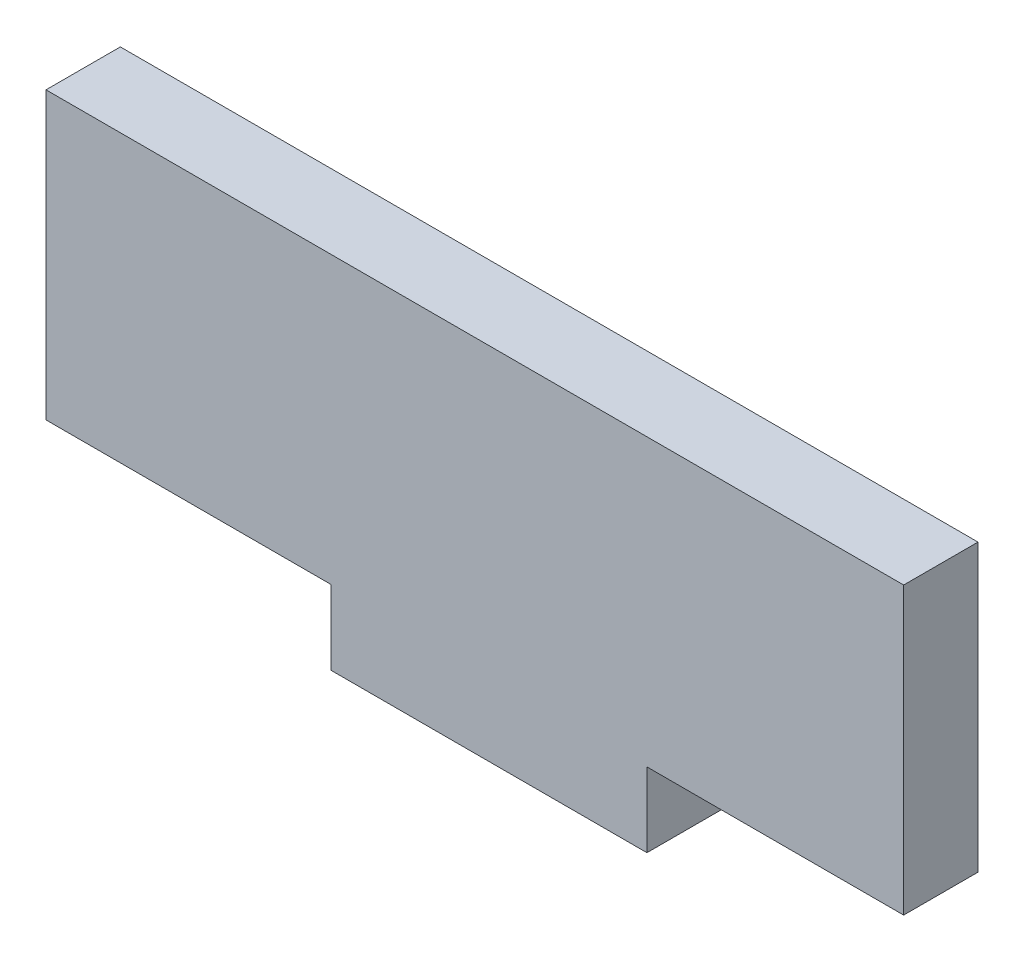
ISO-10303-21;
HEADER;
FILE_DESCRIPTION(('STEP AP214'),'2;1');
FILE_NAME('part.step','',(''),(''),'','','');
FILE_SCHEMA(('AUTOMOTIVE_DESIGN { 1 0 10303 214 1 1 1 1 }'));
ENDSEC;
DATA;
#1=APPLICATION_CONTEXT('core data for automotive mechanical design processes');
#2=APPLICATION_PROTOCOL_DEFINITION('international standard','automotive_design',2000,#1);
#3=PRODUCT_CONTEXT('',#1,'mechanical');
#4=PRODUCT('Part','Part','',(#3));
#5=PRODUCT_RELATED_PRODUCT_CATEGORY('part','',(#4));
#6=PRODUCT_DEFINITION_FORMATION('','',#4);
#7=PRODUCT_DEFINITION_CONTEXT('part definition',#1,'design');
#8=PRODUCT_DEFINITION('design','',#6,#7);
#9=PRODUCT_DEFINITION_SHAPE('','',#8);
#10=(LENGTH_UNIT() NAMED_UNIT(*) SI_UNIT(.MILLI.,.METRE.));
#11=(NAMED_UNIT(*) PLANE_ANGLE_UNIT() SI_UNIT($,.RADIAN.));
#12=(NAMED_UNIT(*) SI_UNIT($,.STERADIAN.) SOLID_ANGLE_UNIT());
#13=UNCERTAINTY_MEASURE_WITH_UNIT(LENGTH_MEASURE(1.E-05),#10,'distance_accuracy_value','');
#14=(GEOMETRIC_REPRESENTATION_CONTEXT(3) GLOBAL_UNCERTAINTY_ASSIGNED_CONTEXT((#13)) GLOBAL_UNIT_ASSIGNED_CONTEXT((#10,
#11,#12)) REPRESENTATION_CONTEXT('',''));
#15=CARTESIAN_POINT('',(0.,0.,0.));
#16=DIRECTION('',(0.,0.,1.));
#17=DIRECTION('',(1.,0.,0.));
#18=AXIS2_PLACEMENT_3D('',#15,#16,#17);
#19=CARTESIAN_POINT('',(0.,0.,2.6));
#20=DIRECTION('',(1.,0.,0.));
#21=DIRECTION('',(0.,0.,-1.));
#22=AXIS2_PLACEMENT_3D('',#19,#20,#21);
#23=PLANE('',#22);
#24=DIRECTION('',(0.,-1.,0.));
#25=VECTOR('',#24,1.);
#26=CARTESIAN_POINT('',(0.,0.,0.));
#27=LINE('',#26,#25);
#28=CARTESIAN_POINT('',(0.,10.,0.));
#29=VERTEX_POINT('',#28);
#30=CARTESIAN_POINT('',(0.,0.,0.));
#31=VERTEX_POINT('',#30);
#32=EDGE_CURVE('E126',#29,#31,#27,.T.);
#33=ORIENTED_EDGE('',*,*,#32,.T.);
#34=DIRECTION('',(0.,0.,-1.));
#35=VECTOR('',#34,1.);
#36=CARTESIAN_POINT('',(0.,0.,2.6));
#37=LINE('',#36,#35);
#38=CARTESIAN_POINT('',(0.,0.,2.6));
#39=VERTEX_POINT('',#38);
#40=EDGE_CURVE('E11',#39,#31,#37,.T.);
#41=ORIENTED_EDGE('',*,*,#40,.F.);
#42=DIRECTION('',(0.,-1.,0.));
#43=VECTOR('',#42,1.);
#44=CARTESIAN_POINT('',(0.,0.,2.6));
#45=LINE('',#44,#43);
#46=CARTESIAN_POINT('',(0.,10.,2.6));
#47=VERTEX_POINT('',#46);
#48=EDGE_CURVE('E140',#47,#39,#45,.T.);
#49=ORIENTED_EDGE('',*,*,#48,.F.);
#50=DIRECTION('',(0.,0.,-1.));
#51=VECTOR('',#50,1.);
#52=CARTESIAN_POINT('',(0.,10.,2.6));
#53=LINE('',#52,#51);
#54=EDGE_CURVE('E122',#47,#29,#53,.T.);
#55=ORIENTED_EDGE('',*,*,#54,.T.);
#56=EDGE_LOOP('',(#33,#41,#49,#55));
#57=FACE_BOUND('',#56,.T.);
#58=ADVANCED_FACE('F30',(#57),#23,.F.);
#59=CARTESIAN_POINT('',(0.,0.,2.6));
#60=DIRECTION('',(0.,1.,0.));
#61=DIRECTION('',(0.,0.,1.));
#62=AXIS2_PLACEMENT_3D('',#59,#60,#61);
#63=PLANE('',#62);
#64=DIRECTION('',(1.,0.,0.));
#65=VECTOR('',#64,1.);
#66=CARTESIAN_POINT('',(0.,0.,0.));
#67=LINE('',#66,#65);
#68=CARTESIAN_POINT('',(9.97731138012756,0.,0.));
#69=VERTEX_POINT('',#68);
#70=EDGE_CURVE('E129',#31,#69,#67,.T.);
#71=ORIENTED_EDGE('',*,*,#70,.T.);
#72=DIRECTION('',(0.,0.,-1.));
#73=VECTOR('',#72,1.);
#74=CARTESIAN_POINT('',(9.97731138012756,0.,2.6));
#75=LINE('',#74,#73);
#76=CARTESIAN_POINT('',(9.97731138012756,0.,2.6));
#77=VERTEX_POINT('',#76);
#78=EDGE_CURVE('E38',#77,#69,#75,.T.);
#79=ORIENTED_EDGE('',*,*,#78,.F.);
#80=DIRECTION('',(1.,0.,0.));
#81=VECTOR('',#80,1.);
#82=CARTESIAN_POINT('',(0.,0.,2.6));
#83=LINE('',#82,#81);
#84=EDGE_CURVE('E89',#39,#77,#83,.T.);
#85=ORIENTED_EDGE('',*,*,#84,.F.);
#86=ORIENTED_EDGE('',*,*,#40,.T.);
#87=EDGE_LOOP('',(#71,#79,#85,#86));
#88=FACE_BOUND('',#87,.T.);
#89=ADVANCED_FACE('F175',(#88),#63,.F.);
#90=CARTESIAN_POINT('',(9.97731138012756,0.,2.6));
#91=DIRECTION('',(1.,0.,0.));
#92=DIRECTION('',(0.,0.,-1.));
#93=AXIS2_PLACEMENT_3D('',#90,#91,#92);
#94=PLANE('',#93);
#95=DIRECTION('',(0.,-1.,0.));
#96=VECTOR('',#95,1.);
#97=CARTESIAN_POINT('',(9.97731138012756,0.,0.));
#98=LINE('',#97,#96);
#99=CARTESIAN_POINT('',(9.97731138012756,-2.6,0.));
#100=VERTEX_POINT('',#99);
#101=EDGE_CURVE('E131',#69,#100,#98,.T.);
#102=ORIENTED_EDGE('',*,*,#101,.T.);
#103=DIRECTION('',(0.,0.,-1.));
#104=VECTOR('',#103,1.);
#105=CARTESIAN_POINT('',(9.97731138012756,-2.6,2.6));
#106=LINE('',#105,#104);
#107=CARTESIAN_POINT('',(9.97731138012756,-2.6,2.6));
#108=VERTEX_POINT('',#107);
#109=EDGE_CURVE('E147',#108,#100,#106,.T.);
#110=ORIENTED_EDGE('',*,*,#109,.F.);
#111=DIRECTION('',(0.,-1.,0.));
#112=VECTOR('',#111,1.);
#113=CARTESIAN_POINT('',(9.97731138012756,0.,2.6));
#114=LINE('',#113,#112);
#115=EDGE_CURVE('E155',#77,#108,#114,.T.);
#116=ORIENTED_EDGE('',*,*,#115,.F.);
#117=ORIENTED_EDGE('',*,*,#78,.T.);
#118=EDGE_LOOP('',(#102,#110,#116,#117));
#119=FACE_BOUND('',#118,.T.);
#120=ADVANCED_FACE('F153',(#119),#94,.F.);
#121=CARTESIAN_POINT('',(9.97731138012756,-2.6,2.6));
#122=DIRECTION('',(0.,1.,0.));
#123=DIRECTION('',(0.,0.,1.));
#124=AXIS2_PLACEMENT_3D('',#121,#122,#123);
#125=PLANE('',#124);
#126=DIRECTION('',(1.,0.,0.));
#127=VECTOR('',#126,1.);
#128=CARTESIAN_POINT('',(9.97731138012756,-2.6,0.));
#129=LINE('',#128,#127);
#130=CARTESIAN_POINT('',(21.0201608688124,-2.6,0.));
#131=VERTEX_POINT('',#130);
#132=EDGE_CURVE('E133',#100,#131,#129,.T.);
#133=ORIENTED_EDGE('',*,*,#132,.T.);
#134=DIRECTION('',(0.,0.,-1.));
#135=VECTOR('',#134,1.);
#136=CARTESIAN_POINT('',(21.0201608688124,-2.6,2.6));
#137=LINE('',#136,#135);
#138=CARTESIAN_POINT('',(21.0201608688124,-2.6,2.6));
#139=VERTEX_POINT('',#138);
#140=EDGE_CURVE('E144',#139,#131,#137,.T.);
#141=ORIENTED_EDGE('',*,*,#140,.F.);
#142=DIRECTION('',(1.,0.,0.));
#143=VECTOR('',#142,1.);
#144=CARTESIAN_POINT('',(9.97731138012756,-2.6,2.6));
#145=LINE('',#144,#143);
#146=EDGE_CURVE('E167',#108,#139,#145,.T.);
#147=ORIENTED_EDGE('',*,*,#146,.F.);
#148=ORIENTED_EDGE('',*,*,#109,.T.);
#149=EDGE_LOOP('',(#133,#141,#147,#148));
#150=FACE_BOUND('',#149,.T.);
#151=ADVANCED_FACE('F163',(#150),#125,.F.);
#152=CARTESIAN_POINT('',(21.0201608688124,0.,2.6));
#153=DIRECTION('',(-1.,0.,0.));
#154=DIRECTION('',(0.,0.,1.));
#155=AXIS2_PLACEMENT_3D('',#152,#153,#154);
#156=PLANE('',#155);
#157=DIRECTION('',(0.,1.,0.));
#158=VECTOR('',#157,1.);
#159=CARTESIAN_POINT('',(21.0201608688124,0.,0.));
#160=LINE('',#159,#158);
#161=CARTESIAN_POINT('',(21.0201608688124,0.,0.));
#162=VERTEX_POINT('',#161);
#163=EDGE_CURVE('E135',#131,#162,#160,.T.);
#164=ORIENTED_EDGE('',*,*,#163,.T.);
#165=DIRECTION('',(0.,0.,-1.));
#166=VECTOR('',#165,1.);
#167=CARTESIAN_POINT('',(21.0201608688124,0.,2.6));
#168=LINE('',#167,#166);
#169=CARTESIAN_POINT('',(21.0201608688124,0.,2.6));
#170=VERTEX_POINT('',#169);
#171=EDGE_CURVE('E117',#170,#162,#168,.T.);
#172=ORIENTED_EDGE('',*,*,#171,.F.);
#173=DIRECTION('',(0.,1.,0.));
#174=VECTOR('',#173,1.);
#175=CARTESIAN_POINT('',(21.0201608688124,0.,2.6));
#176=LINE('',#175,#174);
#177=EDGE_CURVE('E108',#139,#170,#176,.T.);
#178=ORIENTED_EDGE('',*,*,#177,.F.);
#179=ORIENTED_EDGE('',*,*,#140,.T.);
#180=EDGE_LOOP('',(#164,#172,#178,#179));
#181=FACE_BOUND('',#180,.T.);
#182=ADVANCED_FACE('F166',(#181),#156,.F.);
#183=CARTESIAN_POINT('',(21.0201608688124,0.,2.6));
#184=DIRECTION('',(0.,1.,0.));
#185=DIRECTION('',(0.,0.,1.));
#186=AXIS2_PLACEMENT_3D('',#183,#184,#185);
#187=PLANE('',#186);
#188=DIRECTION('',(1.,0.,0.));
#189=VECTOR('',#188,1.);
#190=CARTESIAN_POINT('',(21.0201608688124,0.,0.));
#191=LINE('',#190,#189);
#192=CARTESIAN_POINT('',(30.,0.,0.));
#193=VERTEX_POINT('',#192);
#194=EDGE_CURVE('E116',#162,#193,#191,.T.);
#195=ORIENTED_EDGE('',*,*,#194,.T.);
#196=DIRECTION('',(0.,0.,-1.));
#197=VECTOR('',#196,1.);
#198=CARTESIAN_POINT('',(30.,0.,2.6));
#199=LINE('',#198,#197);
#200=CARTESIAN_POINT('',(30.,0.,2.6));
#201=VERTEX_POINT('',#200);
#202=EDGE_CURVE('E113',#201,#193,#199,.T.);
#203=ORIENTED_EDGE('',*,*,#202,.F.);
#204=DIRECTION('',(1.,0.,0.));
#205=VECTOR('',#204,1.);
#206=CARTESIAN_POINT('',(21.0201608688124,0.,2.6));
#207=LINE('',#206,#205);
#208=EDGE_CURVE('E102',#170,#201,#207,.T.);
#209=ORIENTED_EDGE('',*,*,#208,.F.);
#210=ORIENTED_EDGE('',*,*,#171,.T.);
#211=EDGE_LOOP('',(#195,#203,#209,#210));
#212=FACE_BOUND('',#211,.T.);
#213=ADVANCED_FACE('F114',(#212),#187,.F.);
#214=CARTESIAN_POINT('',(30.,0.,2.6));
#215=DIRECTION('',(-1.,0.,0.));
#216=DIRECTION('',(0.,0.,1.));
#217=AXIS2_PLACEMENT_3D('',#214,#215,#216);
#218=PLANE('',#217);
#219=DIRECTION('',(0.,1.,0.));
#220=VECTOR('',#219,1.);
#221=CARTESIAN_POINT('',(30.,0.,0.));
#222=LINE('',#221,#220);
#223=CARTESIAN_POINT('',(30.,10.,0.));
#224=VERTEX_POINT('',#223);
#225=EDGE_CURVE('E75',#193,#224,#222,.T.);
#226=ORIENTED_EDGE('',*,*,#225,.T.);
#227=DIRECTION('',(0.,0.,-1.));
#228=VECTOR('',#227,1.);
#229=CARTESIAN_POINT('',(30.,10.,2.6));
#230=LINE('',#229,#228);
#231=CARTESIAN_POINT('',(30.,10.,2.6));
#232=VERTEX_POINT('',#231);
#233=EDGE_CURVE('E118',#232,#224,#230,.T.);
#234=ORIENTED_EDGE('',*,*,#233,.F.);
#235=DIRECTION('',(0.,1.,0.));
#236=VECTOR('',#235,1.);
#237=CARTESIAN_POINT('',(30.,0.,2.6));
#238=LINE('',#237,#236);
#239=EDGE_CURVE('E106',#201,#232,#238,.T.);
#240=ORIENTED_EDGE('',*,*,#239,.F.);
#241=ORIENTED_EDGE('',*,*,#202,.T.);
#242=EDGE_LOOP('',(#226,#234,#240,#241));
#243=FACE_BOUND('',#242,.T.);
#244=ADVANCED_FACE('F120',(#243),#218,.F.);
#245=CARTESIAN_POINT('',(0.,10.,2.6));
#246=DIRECTION('',(0.,-1.,0.));
#247=DIRECTION('',(0.,0.,-1.));
#248=AXIS2_PLACEMENT_3D('',#245,#246,#247);
#249=PLANE('',#248);
#250=DIRECTION('',(-1.,0.,0.));
#251=VECTOR('',#250,1.);
#252=CARTESIAN_POINT('',(0.,10.,0.));
#253=LINE('',#252,#251);
#254=EDGE_CURVE('E81',#224,#29,#253,.T.);
#255=ORIENTED_EDGE('',*,*,#254,.T.);
#256=ORIENTED_EDGE('',*,*,#54,.F.);
#257=DIRECTION('',(-1.,0.,0.));
#258=VECTOR('',#257,1.);
#259=CARTESIAN_POINT('',(0.,10.,2.6));
#260=LINE('',#259,#258);
#261=EDGE_CURVE('E46',#232,#47,#260,.T.);
#262=ORIENTED_EDGE('',*,*,#261,.F.);
#263=ORIENTED_EDGE('',*,*,#233,.T.);
#264=EDGE_LOOP('',(#255,#256,#262,#263));
#265=FACE_BOUND('',#264,.T.);
#266=ADVANCED_FACE('F191',(#265),#249,.F.);
#267=CARTESIAN_POINT('',(0.,10.,2.6));
#268=DIRECTION('',(0.,0.,-1.));
#269=DIRECTION('',(-1.,0.,0.));
#270=AXIS2_PLACEMENT_3D('',#267,#268,#269);
#271=PLANE('',#270);
#272=ORIENTED_EDGE('',*,*,#48,.T.);
#273=ORIENTED_EDGE('',*,*,#84,.T.);
#274=ORIENTED_EDGE('',*,*,#115,.T.);
#275=ORIENTED_EDGE('',*,*,#146,.T.);
#276=ORIENTED_EDGE('',*,*,#177,.T.);
#277=ORIENTED_EDGE('',*,*,#208,.T.);
#278=ORIENTED_EDGE('',*,*,#239,.T.);
#279=ORIENTED_EDGE('',*,*,#261,.T.);
#280=EDGE_LOOP('',(#272,#273,#274,#275,#276,#277,#278,#279));
#281=FACE_BOUND('',#280,.T.);
#282=ADVANCED_FACE('F104',(#281),#271,.F.);
#283=CARTESIAN_POINT('',(0.,10.,0.));
#284=DIRECTION('',(0.,0.,-1.));
#285=DIRECTION('',(-1.,0.,0.));
#286=AXIS2_PLACEMENT_3D('',#283,#284,#285);
#287=PLANE('',#286);
#288=ORIENTED_EDGE('',*,*,#32,.F.);
#289=ORIENTED_EDGE('',*,*,#254,.F.);
#290=ORIENTED_EDGE('',*,*,#225,.F.);
#291=ORIENTED_EDGE('',*,*,#194,.F.);
#292=ORIENTED_EDGE('',*,*,#163,.F.);
#293=ORIENTED_EDGE('',*,*,#132,.F.);
#294=ORIENTED_EDGE('',*,*,#101,.F.);
#295=ORIENTED_EDGE('',*,*,#70,.F.);
#296=EDGE_LOOP('',(#288,#289,#290,#291,#292,#293,#294,#295));
#297=FACE_BOUND('',#296,.T.);
#298=ADVANCED_FACE('F159',(#297),#287,.T.);
#299=CLOSED_SHELL('',(#58,#89,#120,#151,#182,#213,#244,#266,#282,#298));
#300=MANIFOLD_SOLID_BREP('B2',#299);
#301=ADVANCED_BREP_SHAPE_REPRESENTATION('',(#18,#300),#14);
#302=SHAPE_DEFINITION_REPRESENTATION(#9,#301);
ENDSEC;
END-ISO-10303-21;
